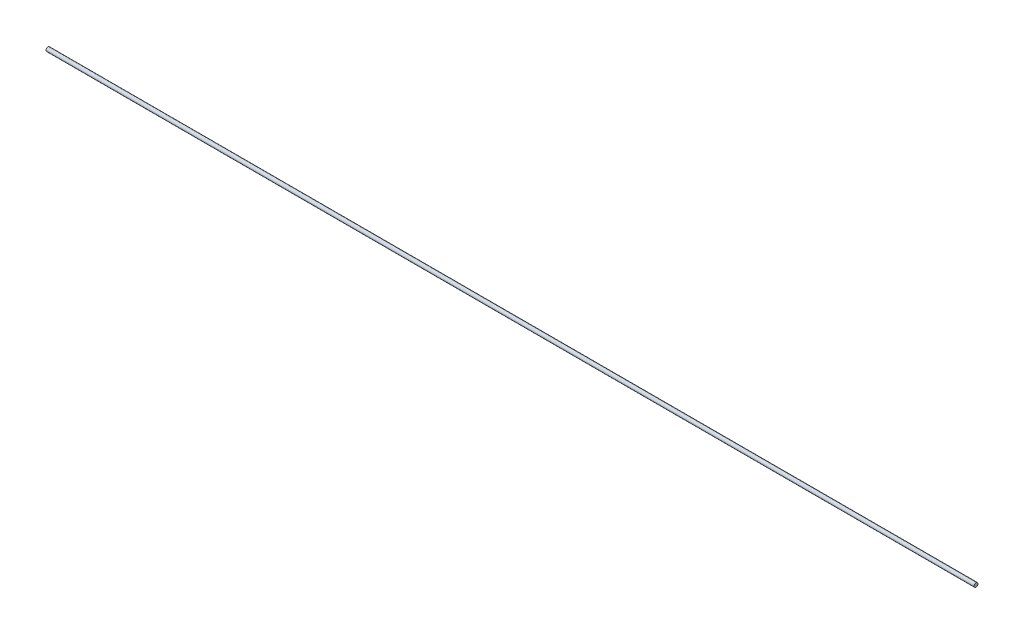
ISO-10303-21;
HEADER;
FILE_DESCRIPTION(('STEP AP214'),'2;1');
FILE_NAME('part.step','',(''),(''),'','','');
FILE_SCHEMA(('AUTOMOTIVE_DESIGN { 1 0 10303 214 1 1 1 1 }'));
ENDSEC;
DATA;
#1=APPLICATION_CONTEXT('core data for automotive mechanical design processes');
#2=APPLICATION_PROTOCOL_DEFINITION('international standard','automotive_design',2000,#1);
#3=PRODUCT_CONTEXT('',#1,'mechanical');
#4=PRODUCT('Part','Part','',(#3));
#5=PRODUCT_RELATED_PRODUCT_CATEGORY('part','',(#4));
#6=PRODUCT_DEFINITION_FORMATION('','',#4);
#7=PRODUCT_DEFINITION_CONTEXT('part definition',#1,'design');
#8=PRODUCT_DEFINITION('design','',#6,#7);
#9=PRODUCT_DEFINITION_SHAPE('','',#8);
#10=(LENGTH_UNIT() NAMED_UNIT(*) SI_UNIT(.MILLI.,.METRE.));
#11=(NAMED_UNIT(*) PLANE_ANGLE_UNIT() SI_UNIT($,.RADIAN.));
#12=(NAMED_UNIT(*) SI_UNIT($,.STERADIAN.) SOLID_ANGLE_UNIT());
#13=UNCERTAINTY_MEASURE_WITH_UNIT(LENGTH_MEASURE(1.E-05),#10,'distance_accuracy_value','');
#14=(GEOMETRIC_REPRESENTATION_CONTEXT(3) GLOBAL_UNCERTAINTY_ASSIGNED_CONTEXT((#13)) GLOBAL_UNIT_ASSIGNED_CONTEXT((#10,
#11,#12)) REPRESENTATION_CONTEXT('',''));
#15=CARTESIAN_POINT('',(0.,0.,0.));
#16=DIRECTION('',(0.,0.,1.));
#17=DIRECTION('',(1.,0.,0.));
#18=AXIS2_PLACEMENT_3D('',#15,#16,#17);
#19=CARTESIAN_POINT('',(300.,0.,0.));
#20=DIRECTION('',(-1.,0.,0.));
#21=DIRECTION('',(0.,0.,1.));
#22=AXIS2_PLACEMENT_3D('',#19,#20,#21);
#23=CYLINDRICAL_SURFACE('',#22,0.635);
#24=CARTESIAN_POINT('',(300.,0.,0.));
#25=DIRECTION('',(1.,0.,0.));
#26=DIRECTION('',(0.,0.,-1.));
#27=AXIS2_PLACEMENT_3D('',#24,#25,#26);
#28=CIRCLE('',#27,0.635);
#29=CARTESIAN_POINT('',(300.,0.,-0.635));
#30=VERTEX_POINT('',#29);
#31=EDGE_CURVE('E10',#30,#30,#28,.T.);
#32=ORIENTED_EDGE('',*,*,#31,.F.);
#33=EDGE_LOOP('',(#32));
#34=FACE_BOUND('',#33,.T.);
#35=CARTESIAN_POINT('',(0.,0.,0.));
#36=DIRECTION('',(1.,0.,0.));
#37=DIRECTION('',(0.,0.,-1.));
#38=AXIS2_PLACEMENT_3D('',#35,#36,#37);
#39=CIRCLE('',#38,0.635);
#40=CARTESIAN_POINT('',(0.,0.,-0.635));
#41=VERTEX_POINT('',#40);
#42=EDGE_CURVE('E34',#41,#41,#39,.T.);
#43=ORIENTED_EDGE('',*,*,#42,.T.);
#44=EDGE_LOOP('',(#43));
#45=FACE_BOUND('',#44,.T.);
#46=ADVANCED_FACE('F31',(#34,#45),#23,.T.);
#47=CARTESIAN_POINT('',(300.,0.,0.));
#48=DIRECTION('',(1.,0.,0.));
#49=DIRECTION('',(0.,0.,-1.));
#50=AXIS2_PLACEMENT_3D('',#47,#48,#49);
#51=PLANE('',#50);
#52=ORIENTED_EDGE('',*,*,#31,.T.);
#53=EDGE_LOOP('',(#52));
#54=FACE_BOUND('',#53,.T.);
#55=ADVANCED_FACE('F46',(#54),#51,.T.);
#56=CARTESIAN_POINT('',(0.,0.,0.));
#57=DIRECTION('',(1.,0.,0.));
#58=DIRECTION('',(0.,0.,-1.));
#59=AXIS2_PLACEMENT_3D('',#56,#57,#58);
#60=PLANE('',#59);
#61=ORIENTED_EDGE('',*,*,#42,.F.);
#62=EDGE_LOOP('',(#61));
#63=FACE_BOUND('',#62,.T.);
#64=ADVANCED_FACE('F44',(#63),#60,.F.);
#65=CLOSED_SHELL('',(#46,#55,#64));
#66=MANIFOLD_SOLID_BREP('B2',#65);
#67=ADVANCED_BREP_SHAPE_REPRESENTATION('',(#18,#66),#14);
#68=SHAPE_DEFINITION_REPRESENTATION(#9,#67);
ENDSEC;
END-ISO-10303-21;
